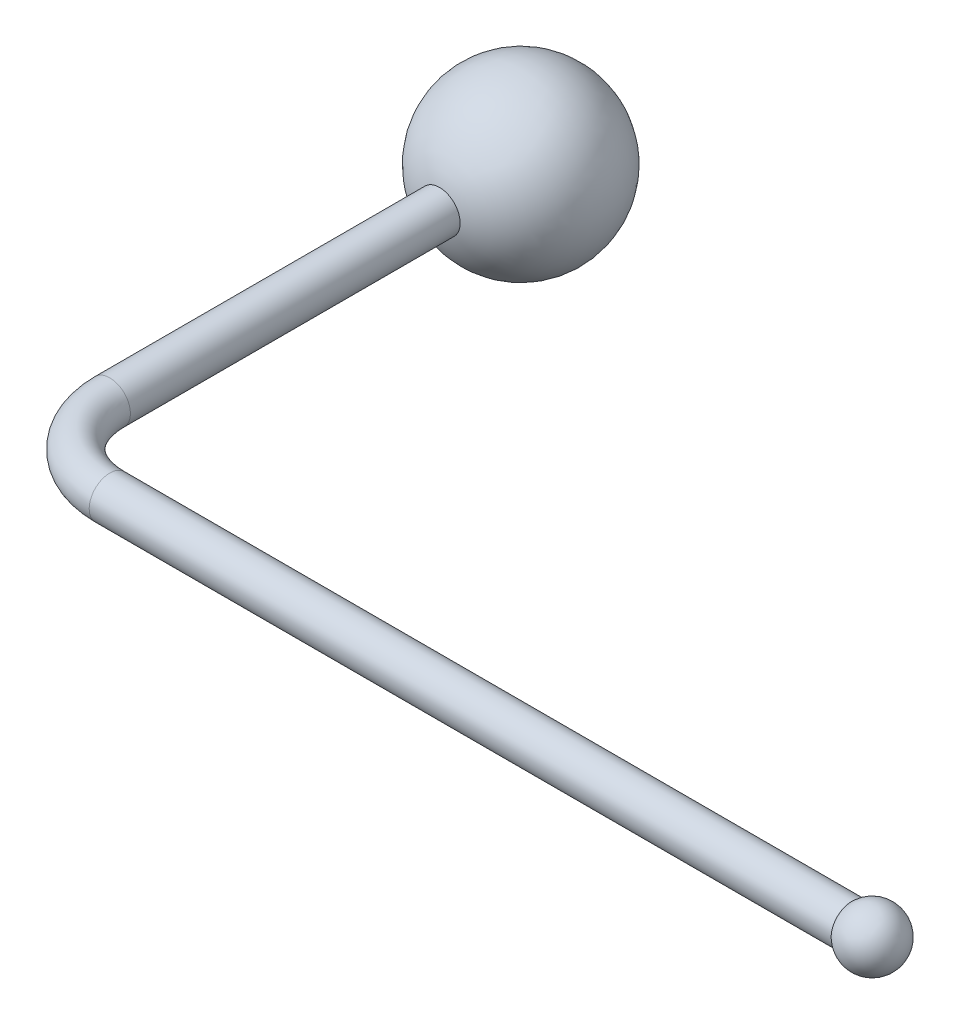
ISO-10303-21;
HEADER;
FILE_DESCRIPTION(('STEP AP214'),'2;1');
FILE_NAME('part.step','',(''),(''),'','','');
FILE_SCHEMA(('AUTOMOTIVE_DESIGN { 1 0 10303 214 1 1 1 1 }'));
ENDSEC;
DATA;
#1=APPLICATION_CONTEXT('core data for automotive mechanical design processes');
#2=APPLICATION_PROTOCOL_DEFINITION('international standard','automotive_design',2000,#1);
#3=PRODUCT_CONTEXT('',#1,'mechanical');
#4=PRODUCT('Part','Part','',(#3));
#5=PRODUCT_RELATED_PRODUCT_CATEGORY('part','',(#4));
#6=PRODUCT_DEFINITION_FORMATION('','',#4);
#7=PRODUCT_DEFINITION_CONTEXT('part definition',#1,'design');
#8=PRODUCT_DEFINITION('design','',#6,#7);
#9=PRODUCT_DEFINITION_SHAPE('','',#8);
#10=(LENGTH_UNIT() NAMED_UNIT(*) SI_UNIT(.MILLI.,.METRE.));
#11=(NAMED_UNIT(*) PLANE_ANGLE_UNIT() SI_UNIT($,.RADIAN.));
#12=(NAMED_UNIT(*) SI_UNIT($,.STERADIAN.) SOLID_ANGLE_UNIT());
#13=UNCERTAINTY_MEASURE_WITH_UNIT(LENGTH_MEASURE(1.E-05),#10,'distance_accuracy_value','');
#14=(GEOMETRIC_REPRESENTATION_CONTEXT(3) GLOBAL_UNCERTAINTY_ASSIGNED_CONTEXT((#13)) GLOBAL_UNIT_ASSIGNED_CONTEXT((#10,
#11,#12)) REPRESENTATION_CONTEXT('',''));
#15=CARTESIAN_POINT('',(0.,0.,0.));
#16=DIRECTION('',(0.,0.,1.));
#17=DIRECTION('',(1.,0.,0.));
#18=AXIS2_PLACEMENT_3D('',#15,#16,#17);
#19=CARTESIAN_POINT('',(10.,0.,50.));
#20=DIRECTION('',(1.,0.,0.));
#21=DIRECTION('',(0.,1.,0.));
#22=AXIS2_PLACEMENT_3D('',#19,#20,#21);
#23=CYLINDRICAL_SURFACE('',#22,2.5);
#24=CARTESIAN_POINT('',(10.,0.,50.));
#25=DIRECTION('',(1.,0.,0.));
#26=DIRECTION('',(0.,0.,-1.));
#27=AXIS2_PLACEMENT_3D('',#24,#25,#26);
#28=CIRCLE('',#27,2.5);
#29=CARTESIAN_POINT('',(10.,0.,52.5));
#30=VERTEX_POINT('',#29);
#31=EDGE_CURVE('E38',#30,#30,#28,.T.);
#32=ORIENTED_EDGE('',*,*,#31,.T.);
#33=EDGE_LOOP('',(#32));
#34=FACE_BOUND('',#33,.T.);
#35=CARTESIAN_POINT('',(100.,0.,50.));
#36=DIRECTION('',(1.,0.,0.));
#37=DIRECTION('',(0.,0.,-1.));
#38=AXIS2_PLACEMENT_3D('',#35,#36,#37);
#39=CIRCLE('',#38,2.5);
#40=CARTESIAN_POINT('',(100.,0.,47.5));
#41=VERTEX_POINT('',#40);
#42=EDGE_CURVE('E10',#41,#41,#39,.T.);
#43=ORIENTED_EDGE('',*,*,#42,.F.);
#44=EDGE_LOOP('',(#43));
#45=FACE_BOUND('',#44,.T.);
#46=ADVANCED_FACE('F30',(#34,#45),#23,.T.);
#47=CARTESIAN_POINT('',(10.,0.,40.));
#48=DIRECTION('',(0.,1.,0.));
#49=DIRECTION('',(0.,0.,1.));
#50=AXIS2_PLACEMENT_3D('',#47,#48,#49);
#51=TOROIDAL_SURFACE('',#50,10.,2.5);
#52=CARTESIAN_POINT('',(0.,0.,40.));
#53=DIRECTION('',(0.,0.,1.));
#54=DIRECTION('',(1.,0.,0.));
#55=AXIS2_PLACEMENT_3D('',#52,#53,#54);
#56=CIRCLE('',#55,2.5);
#57=CARTESIAN_POINT('',(-2.5,0.,40.));
#58=VERTEX_POINT('',#57);
#59=EDGE_CURVE('E42',#58,#58,#56,.T.);
#60=CARTESIAN_POINT('',(10.,0.,40.));
#61=DIRECTION('',(0.,1.,0.));
#62=DIRECTION('',(0.,0.,1.));
#63=AXIS2_PLACEMENT_3D('',#60,#61,#62);
#64=CIRCLE('',#63,12.5);
#65=EDGE_CURVE('',#58,#30,#64,.T.);
#66=ORIENTED_EDGE('',*,*,#59,.T.);
#67=ORIENTED_EDGE('',*,*,#31,.F.);
#68=ORIENTED_EDGE('',*,*,#65,.T.);
#69=ORIENTED_EDGE('',*,*,#65,.F.);
#70=EDGE_LOOP('',(#66,#68,#67,#69));
#71=FACE_BOUND('',#70,.T.);
#72=ADVANCED_FACE('F59',(#71),#51,.T.);
#73=CARTESIAN_POINT('',(0.,0.,40.));
#74=DIRECTION('',(0.,0.,-1.));
#75=DIRECTION('',(-1.,0.,0.));
#76=AXIS2_PLACEMENT_3D('',#73,#74,#75);
#77=CYLINDRICAL_SURFACE('',#76,2.5);
#78=ORIENTED_EDGE('',*,*,#59,.F.);
#79=EDGE_LOOP('',(#78));
#80=FACE_BOUND('',#79,.T.);
#81=CARTESIAN_POINT('',(0.,0.,0.));
#82=DIRECTION('',(0.,0.,1.));
#83=DIRECTION('',(1.,0.,0.));
#84=AXIS2_PLACEMENT_3D('',#81,#82,#83);
#85=CIRCLE('',#84,2.5);
#86=CARTESIAN_POINT('',(2.5,0.,0.));
#87=VERTEX_POINT('',#86);
#88=EDGE_CURVE('E34',#87,#87,#85,.T.);
#89=ORIENTED_EDGE('',*,*,#88,.T.);
#90=EDGE_LOOP('',(#89));
#91=FACE_BOUND('',#90,.T.);
#92=ADVANCED_FACE('F51',(#80,#91),#77,.T.);
#93=CARTESIAN_POINT('',(102.479166666667,0.,50.));
#94=DIRECTION('',(0.,0.,1.));
#95=DIRECTION('',(1.,0.,0.));
#96=AXIS2_PLACEMENT_3D('',#93,#94,#95);
#97=SPHERICAL_SURFACE('',#96,3.52083333333334);
#98=CARTESIAN_POINT('',(102.479166666667,0.,50.));
#99=DIRECTION('',(1.,0.,0.));
#100=DIRECTION('',(0.,0.,-1.));
#101=AXIS2_PLACEMENT_3D('',#98,#99,#100);
#102=SPHERICAL_SURFACE('',#101,3.52083333333334);
#103=ORIENTED_EDGE('',*,*,#42,.T.);
#104=EDGE_LOOP('',(#103));
#105=FACE_BOUND('',#104,.T.);
#106=ADVANCED_FACE('F54',(#105),#102,.T.);
#107=CARTESIAN_POINT('',(0.,0.,-9.84375));
#108=DIRECTION('',(0.,0.,1.));
#109=DIRECTION('',(1.,0.,0.));
#110=AXIS2_PLACEMENT_3D('',#107,#108,#109);
#111=SPHERICAL_SURFACE('',#110,10.15625);
#112=ORIENTED_EDGE('',*,*,#88,.F.);
#113=EDGE_LOOP('',(#112));
#114=FACE_BOUND('',#113,.T.);
#115=ADVANCED_FACE('F32',(#114),#111,.T.);
#116=CLOSED_SHELL('',(#46,#72,#92,#106,#115));
#117=MANIFOLD_SOLID_BREP('B2',#116);
#118=ADVANCED_BREP_SHAPE_REPRESENTATION('',(#18,#117),#14);
#119=SHAPE_DEFINITION_REPRESENTATION(#9,#118);
ENDSEC;
END-ISO-10303-21;
